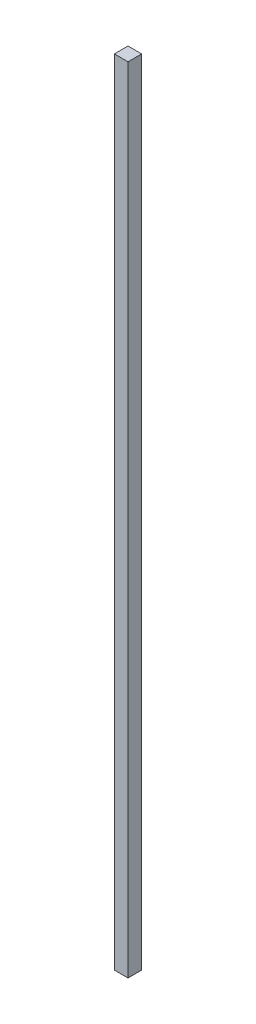
ISO-10303-21;
HEADER;
FILE_DESCRIPTION(('STEP AP214'),'2;1');
FILE_NAME('part.step','',(''),(''),'','','');
FILE_SCHEMA(('AUTOMOTIVE_DESIGN { 1 0 10303 214 1 1 1 1 }'));
ENDSEC;
DATA;
#1=APPLICATION_CONTEXT('core data for automotive mechanical design processes');
#2=APPLICATION_PROTOCOL_DEFINITION('international standard','automotive_design',2000,#1);
#3=PRODUCT_CONTEXT('',#1,'mechanical');
#4=PRODUCT('Part','Part','',(#3));
#5=PRODUCT_RELATED_PRODUCT_CATEGORY('part','',(#4));
#6=PRODUCT_DEFINITION_FORMATION('','',#4);
#7=PRODUCT_DEFINITION_CONTEXT('part definition',#1,'design');
#8=PRODUCT_DEFINITION('design','',#6,#7);
#9=PRODUCT_DEFINITION_SHAPE('','',#8);
#10=(LENGTH_UNIT() NAMED_UNIT(*) SI_UNIT(.MILLI.,.METRE.));
#11=(NAMED_UNIT(*) PLANE_ANGLE_UNIT() SI_UNIT($,.RADIAN.));
#12=(NAMED_UNIT(*) SI_UNIT($,.STERADIAN.) SOLID_ANGLE_UNIT());
#13=UNCERTAINTY_MEASURE_WITH_UNIT(LENGTH_MEASURE(1.E-05),#10,'distance_accuracy_value','');
#14=(GEOMETRIC_REPRESENTATION_CONTEXT(3) GLOBAL_UNCERTAINTY_ASSIGNED_CONTEXT((#13)) GLOBAL_UNIT_ASSIGNED_CONTEXT((#10,
#11,#12)) REPRESENTATION_CONTEXT('',''));
#15=CARTESIAN_POINT('',(0.,0.,0.));
#16=DIRECTION('',(0.,0.,1.));
#17=DIRECTION('',(1.,0.,0.));
#18=AXIS2_PLACEMENT_3D('',#15,#16,#17);
#19=CARTESIAN_POINT('',(4.44089209850063E-13,1473.2,0.));
#20=DIRECTION('',(1.,0.,0.));
#21=DIRECTION('',(0.,0.,-1.));
#22=AXIS2_PLACEMENT_3D('',#19,#20,#21);
#23=PLANE('',#22);
#24=DIRECTION('',(0.,0.,1.));
#25=VECTOR('',#24,1.);
#26=CARTESIAN_POINT('',(0.,0.,0.));
#27=LINE('',#26,#25);
#28=CARTESIAN_POINT('',(0.,1.11022302462516E-13,-25.4000000000001));
#29=VERTEX_POINT('',#28);
#30=CARTESIAN_POINT('',(0.,0.,0.));
#31=VERTEX_POINT('',#30);
#32=EDGE_CURVE('E97',#29,#31,#27,.T.);
#33=ORIENTED_EDGE('',*,*,#32,.T.);
#34=DIRECTION('',(0.,-1.,0.));
#35=VECTOR('',#34,1.);
#36=CARTESIAN_POINT('',(4.44089209850063E-13,1473.2,0.));
#37=LINE('',#36,#35);
#38=CARTESIAN_POINT('',(4.44089209850063E-13,1473.2,0.));
#39=VERTEX_POINT('',#38);
#40=EDGE_CURVE('E11',#39,#31,#37,.T.);
#41=ORIENTED_EDGE('',*,*,#40,.F.);
#42=DIRECTION('',(0.,0.,1.));
#43=VECTOR('',#42,1.);
#44=CARTESIAN_POINT('',(4.44089209850063E-13,1473.2,0.));
#45=LINE('',#44,#43);
#46=CARTESIAN_POINT('',(4.44089209850063E-13,1473.2,-25.4000000000001));
#47=VERTEX_POINT('',#46);
#48=EDGE_CURVE('E85',#47,#39,#45,.T.);
#49=ORIENTED_EDGE('',*,*,#48,.F.);
#50=DIRECTION('',(0.,-1.,0.));
#51=VECTOR('',#50,1.);
#52=CARTESIAN_POINT('',(4.44089209850063E-13,1473.2,-25.4000000000001));
#53=LINE('',#52,#51);
#54=EDGE_CURVE('E93',#47,#29,#53,.T.);
#55=ORIENTED_EDGE('',*,*,#54,.T.);
#56=EDGE_LOOP('',(#33,#41,#49,#55));
#57=FACE_BOUND('',#56,.T.);
#58=ADVANCED_FACE('F34',(#57),#23,.F.);
#59=CARTESIAN_POINT('',(4.44089209850063E-13,1473.2,0.));
#60=DIRECTION('',(0.,0.,-1.));
#61=DIRECTION('',(-1.,0.,0.));
#62=AXIS2_PLACEMENT_3D('',#59,#60,#61);
#63=PLANE('',#62);
#64=DIRECTION('',(1.,0.,0.));
#65=VECTOR('',#64,1.);
#66=CARTESIAN_POINT('',(0.,0.,0.));
#67=LINE('',#66,#65);
#68=CARTESIAN_POINT('',(25.3999999999999,0.,0.));
#69=VERTEX_POINT('',#68);
#70=EDGE_CURVE('E89',#31,#69,#67,.T.);
#71=ORIENTED_EDGE('',*,*,#70,.T.);
#72=DIRECTION('',(0.,-1.,0.));
#73=VECTOR('',#72,1.);
#74=CARTESIAN_POINT('',(25.400000000003,1473.20000000001,0.));
#75=LINE('',#74,#73);
#76=CARTESIAN_POINT('',(25.400000000003,1473.20000000001,0.));
#77=VERTEX_POINT('',#76);
#78=EDGE_CURVE('E42',#77,#69,#75,.T.);
#79=ORIENTED_EDGE('',*,*,#78,.F.);
#80=DIRECTION('',(1.,0.,0.));
#81=VECTOR('',#80,1.);
#82=CARTESIAN_POINT('',(4.44089209850063E-13,1473.2,0.));
#83=LINE('',#82,#81);
#84=EDGE_CURVE('E80',#39,#77,#83,.T.);
#85=ORIENTED_EDGE('',*,*,#84,.F.);
#86=ORIENTED_EDGE('',*,*,#40,.T.);
#87=EDGE_LOOP('',(#71,#79,#85,#86));
#88=FACE_BOUND('',#87,.T.);
#89=ADVANCED_FACE('F88',(#88),#63,.F.);
#90=CARTESIAN_POINT('',(25.400000000003,1473.20000000001,0.));
#91=DIRECTION('',(-1.,0.,0.));
#92=DIRECTION('',(0.,0.,1.));
#93=AXIS2_PLACEMENT_3D('',#90,#91,#92);
#94=PLANE('',#93);
#95=DIRECTION('',(0.,0.,-1.));
#96=VECTOR('',#95,1.);
#97=CARTESIAN_POINT('',(25.3999999999999,0.,0.));
#98=LINE('',#97,#96);
#99=CARTESIAN_POINT('',(25.3999999999999,1.11022302462516E-13,-25.4000000000001));
#100=VERTEX_POINT('',#99);
#101=EDGE_CURVE('E67',#69,#100,#98,.T.);
#102=ORIENTED_EDGE('',*,*,#101,.T.);
#103=DIRECTION('',(0.,-1.,0.));
#104=VECTOR('',#103,1.);
#105=CARTESIAN_POINT('',(25.400000000003,1473.20000000001,-25.4000000000001));
#106=LINE('',#105,#104);
#107=CARTESIAN_POINT('',(25.400000000003,1473.20000000001,-25.4000000000001));
#108=VERTEX_POINT('',#107);
#109=EDGE_CURVE('E90',#108,#100,#106,.T.);
#110=ORIENTED_EDGE('',*,*,#109,.F.);
#111=DIRECTION('',(0.,0.,-1.));
#112=VECTOR('',#111,1.);
#113=CARTESIAN_POINT('',(25.400000000003,1473.20000000001,0.));
#114=LINE('',#113,#112);
#115=EDGE_CURVE('E83',#77,#108,#114,.T.);
#116=ORIENTED_EDGE('',*,*,#115,.F.);
#117=ORIENTED_EDGE('',*,*,#78,.T.);
#118=EDGE_LOOP('',(#102,#110,#116,#117));
#119=FACE_BOUND('',#118,.T.);
#120=ADVANCED_FACE('F91',(#119),#94,.F.);
#121=CARTESIAN_POINT('',(4.44089209850063E-13,1473.2,-25.4000000000001));
#122=DIRECTION('',(0.,0.,1.));
#123=DIRECTION('',(1.,0.,0.));
#124=AXIS2_PLACEMENT_3D('',#121,#122,#123);
#125=PLANE('',#124);
#126=DIRECTION('',(-1.,0.,0.));
#127=VECTOR('',#126,1.);
#128=CARTESIAN_POINT('',(0.,1.11022302462516E-13,-25.4000000000001));
#129=LINE('',#128,#127);
#130=EDGE_CURVE('E73',#100,#29,#129,.T.);
#131=ORIENTED_EDGE('',*,*,#130,.T.);
#132=ORIENTED_EDGE('',*,*,#54,.F.);
#133=DIRECTION('',(-1.,0.,0.));
#134=VECTOR('',#133,1.);
#135=CARTESIAN_POINT('',(4.44089209850063E-13,1473.2,-25.4000000000001));
#136=LINE('',#135,#134);
#137=EDGE_CURVE('E50',#108,#47,#136,.T.);
#138=ORIENTED_EDGE('',*,*,#137,.F.);
#139=ORIENTED_EDGE('',*,*,#109,.T.);
#140=EDGE_LOOP('',(#131,#132,#138,#139));
#141=FACE_BOUND('',#140,.T.);
#142=ADVANCED_FACE('F104',(#141),#125,.F.);
#143=CARTESIAN_POINT('',(4.44089209850063E-13,1473.2,0.));
#144=DIRECTION('',(0.,-1.,0.));
#145=DIRECTION('',(0.,0.,-1.));
#146=AXIS2_PLACEMENT_3D('',#143,#144,#145);
#147=PLANE('',#146);
#148=ORIENTED_EDGE('',*,*,#48,.T.);
#149=ORIENTED_EDGE('',*,*,#84,.T.);
#150=ORIENTED_EDGE('',*,*,#115,.T.);
#151=ORIENTED_EDGE('',*,*,#137,.T.);
#152=EDGE_LOOP('',(#148,#149,#150,#151));
#153=FACE_BOUND('',#152,.T.);
#154=ADVANCED_FACE('F81',(#153),#147,.F.);
#155=CARTESIAN_POINT('',(0.,0.,0.));
#156=DIRECTION('',(0.,-1.,0.));
#157=DIRECTION('',(0.,0.,-1.));
#158=AXIS2_PLACEMENT_3D('',#155,#156,#157);
#159=PLANE('',#158);
#160=ORIENTED_EDGE('',*,*,#32,.F.);
#161=ORIENTED_EDGE('',*,*,#130,.F.);
#162=ORIENTED_EDGE('',*,*,#101,.F.);
#163=ORIENTED_EDGE('',*,*,#70,.F.);
#164=EDGE_LOOP('',(#160,#161,#162,#163));
#165=FACE_BOUND('',#164,.T.);
#166=ADVANCED_FACE('F107',(#165),#159,.T.);
#167=CLOSED_SHELL('',(#58,#89,#120,#142,#154,#166));
#168=MANIFOLD_SOLID_BREP('B2',#167);
#169=ADVANCED_BREP_SHAPE_REPRESENTATION('',(#18,#168),#14);
#170=SHAPE_DEFINITION_REPRESENTATION(#9,#169);
ENDSEC;
END-ISO-10303-21;
